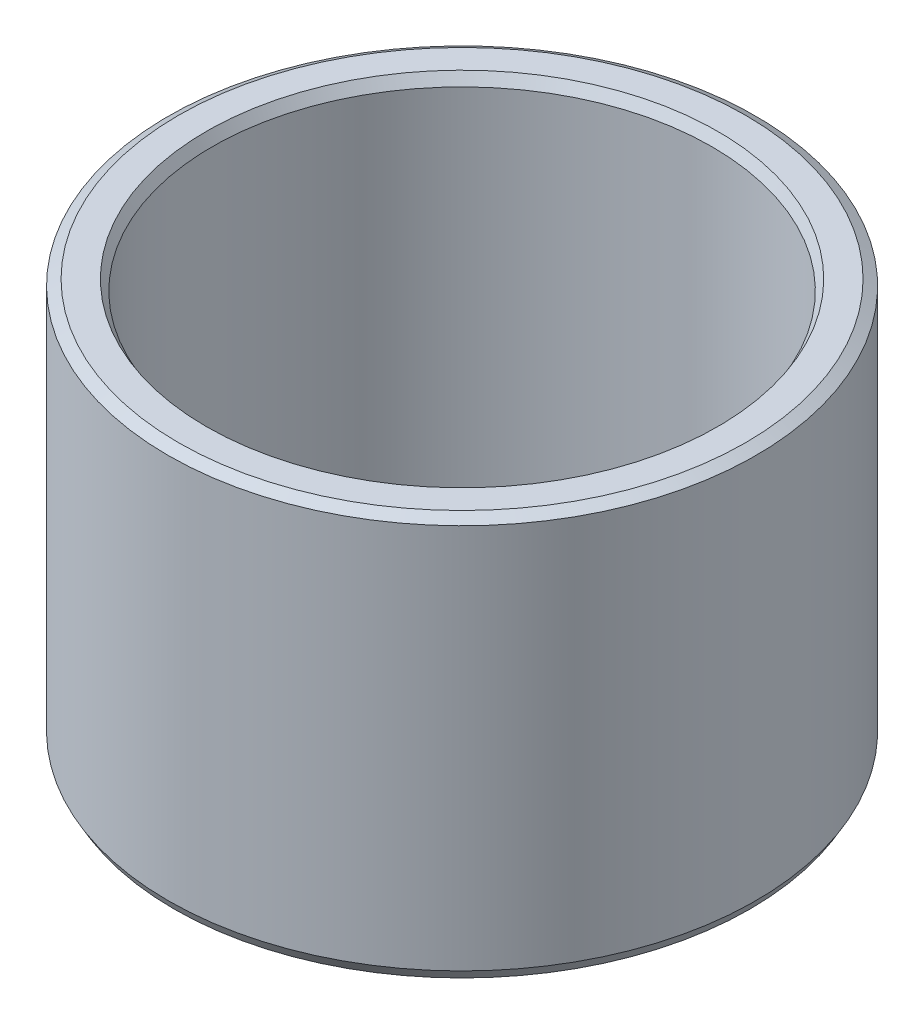
ISO-10303-21;
HEADER;
FILE_DESCRIPTION(('STEP AP214'),'2;1');
FILE_NAME('part.step','',(''),(''),'','','');
FILE_SCHEMA(('AUTOMOTIVE_DESIGN { 1 0 10303 214 1 1 1 1 }'));
ENDSEC;
DATA;
#1=APPLICATION_CONTEXT('core data for automotive mechanical design processes');
#2=APPLICATION_PROTOCOL_DEFINITION('international standard','automotive_design',2000,#1);
#3=PRODUCT_CONTEXT('',#1,'mechanical');
#4=PRODUCT('Part','Part','',(#3));
#5=PRODUCT_RELATED_PRODUCT_CATEGORY('part','',(#4));
#6=PRODUCT_DEFINITION_FORMATION('','',#4);
#7=PRODUCT_DEFINITION_CONTEXT('part definition',#1,'design');
#8=PRODUCT_DEFINITION('design','',#6,#7);
#9=PRODUCT_DEFINITION_SHAPE('','',#8);
#10=(LENGTH_UNIT() NAMED_UNIT(*) SI_UNIT(.MILLI.,.METRE.));
#11=(NAMED_UNIT(*) PLANE_ANGLE_UNIT() SI_UNIT($,.RADIAN.));
#12=(NAMED_UNIT(*) SI_UNIT($,.STERADIAN.) SOLID_ANGLE_UNIT());
#13=UNCERTAINTY_MEASURE_WITH_UNIT(LENGTH_MEASURE(1.E-05),#10,'distance_accuracy_value','');
#14=(GEOMETRIC_REPRESENTATION_CONTEXT(3) GLOBAL_UNCERTAINTY_ASSIGNED_CONTEXT((#13)) GLOBAL_UNIT_ASSIGNED_CONTEXT((#10,
#11,#12)) REPRESENTATION_CONTEXT('',''));
#15=CARTESIAN_POINT('',(0.,0.,0.));
#16=DIRECTION('',(0.,0.,1.));
#17=DIRECTION('',(1.,0.,0.));
#18=AXIS2_PLACEMENT_3D('',#15,#16,#17);
#19=CARTESIAN_POINT('',(0.,44.4365752753032,0.));
#20=DIRECTION('',(0.,-1.,0.));
#21=DIRECTION('',(0.,0.,-1.));
#22=AXIS2_PLACEMENT_3D('',#19,#20,#21);
#23=CYLINDRICAL_SURFACE('',#22,32.5);
#24=CARTESIAN_POINT('',(0.,1.13785269703768,0.));
#25=DIRECTION('',(0.,1.,0.));
#26=DIRECTION('',(0.,0.,1.));
#27=AXIS2_PLACEMENT_3D('',#24,#25,#26);
#28=CIRCLE('',#27,32.5);
#29=CARTESIAN_POINT('',(0.,1.13785269703768,32.5));
#30=VERTEX_POINT('',#29);
#31=EDGE_CURVE('E10',#30,#30,#28,.T.);
#32=ORIENTED_EDGE('',*,*,#31,.T.);
#33=EDGE_LOOP('',(#32));
#34=FACE_BOUND('',#33,.T.);
#35=CARTESIAN_POINT('',(0.,43.7796357143703,0.));
#36=DIRECTION('',(0.,1.,0.));
#37=DIRECTION('',(0.,0.,1.));
#38=AXIS2_PLACEMENT_3D('',#35,#36,#37);
#39=CIRCLE('',#38,32.5);
#40=CARTESIAN_POINT('',(0.,43.7796357143703,32.5));
#41=VERTEX_POINT('',#40);
#42=EDGE_CURVE('E50',#41,#41,#39,.F.);
#43=ORIENTED_EDGE('',*,*,#42,.T.);
#44=EDGE_LOOP('',(#43));
#45=FACE_BOUND('',#44,.T.);
#46=ADVANCED_FACE('F39',(#34,#45),#23,.T.);
#47=CARTESIAN_POINT('',(0.,44.4365752753032,0.));
#48=DIRECTION('',(0.,1.,0.));
#49=DIRECTION('',(0.,0.,1.));
#50=AXIS2_PLACEMENT_3D('',#47,#48,#49);
#51=PLANE('',#50);
#52=CARTESIAN_POINT('',(0.,44.4365752753032,0.));
#53=DIRECTION('',(0.,1.,0.));
#54=DIRECTION('',(0.,0.,1.));
#55=AXIS2_PLACEMENT_3D('',#52,#53,#54);
#56=CIRCLE('',#55,28.2857885351654);
#57=CARTESIAN_POINT('',(0.,44.4365752753032,28.2857885351654));
#58=VERTEX_POINT('',#57);
#59=EDGE_CURVE('E58',#58,#58,#56,.F.);
#60=ORIENTED_EDGE('',*,*,#59,.T.);
#61=EDGE_LOOP('',(#60));
#62=FACE_BOUND('',#61,.T.);
#63=CARTESIAN_POINT('',(0.,44.4365752753032,0.));
#64=DIRECTION('',(0.,1.,0.));
#65=DIRECTION('',(0.,0.,1.));
#66=AXIS2_PLACEMENT_3D('',#63,#64,#65);
#67=CIRCLE('',#66,31.3621473029623);
#68=CARTESIAN_POINT('',(0.,44.4365752753032,31.3621473029623));
#69=VERTEX_POINT('',#68);
#70=EDGE_CURVE('E61',#69,#69,#67,.T.);
#71=ORIENTED_EDGE('',*,*,#70,.T.);
#72=EDGE_LOOP('',(#71));
#73=FACE_BOUND('',#72,.T.);
#74=ADVANCED_FACE('F88',(#62,#73),#51,.T.);
#75=CARTESIAN_POINT('',(0.,0.,0.));
#76=DIRECTION('',(0.,1.,0.));
#77=DIRECTION('',(0.,0.,1.));
#78=AXIS2_PLACEMENT_3D('',#75,#76,#77);
#79=PLANE('',#78);
#80=CARTESIAN_POINT('',(0.,0.,0.));
#81=DIRECTION('',(0.,1.,0.));
#82=DIRECTION('',(0.,0.,1.));
#83=AXIS2_PLACEMENT_3D('',#80,#81,#82);
#84=CIRCLE('',#83,28.7667016712702);
#85=CARTESIAN_POINT('',(0.,0.,28.7667016712702));
#86=VERTEX_POINT('',#85);
#87=EDGE_CURVE('E51',#86,#86,#84,.T.);
#88=ORIENTED_EDGE('',*,*,#87,.T.);
#89=EDGE_LOOP('',(#88));
#90=FACE_BOUND('',#89,.T.);
#91=CARTESIAN_POINT('',(0.,0.,0.));
#92=DIRECTION('',(0.,1.,0.));
#93=DIRECTION('',(0.,0.,1.));
#94=AXIS2_PLACEMENT_3D('',#91,#92,#93);
#95=CIRCLE('',#94,31.8430604390672);
#96=CARTESIAN_POINT('',(0.,0.,31.8430604390672));
#97=VERTEX_POINT('',#96);
#98=EDGE_CURVE('E54',#97,#97,#95,.F.);
#99=ORIENTED_EDGE('',*,*,#98,.T.);
#100=EDGE_LOOP('',(#99));
#101=FACE_BOUND('',#100,.T.);
#102=ADVANCED_FACE('F83',(#90,#101),#79,.F.);
#103=CARTESIAN_POINT('',(0.,44.4365752753032,0.));
#104=DIRECTION('',(0.,-1.,0.));
#105=DIRECTION('',(0.,0.,-1.));
#106=AXIS2_PLACEMENT_3D('',#103,#104,#105);
#107=CYLINDRICAL_SURFACE('',#106,27.6288489742326);
#108=CARTESIAN_POINT('',(0.,43.2987225782656,0.));
#109=DIRECTION('',(0.,1.,0.));
#110=DIRECTION('',(0.,0.,1.));
#111=AXIS2_PLACEMENT_3D('',#108,#109,#110);
#112=CIRCLE('',#111,27.6288489742326);
#113=CARTESIAN_POINT('',(0.,43.2987225782656,27.6288489742326));
#114=VERTEX_POINT('',#113);
#115=EDGE_CURVE('E67',#114,#114,#112,.T.);
#116=ORIENTED_EDGE('',*,*,#115,.T.);
#117=EDGE_LOOP('',(#116));
#118=FACE_BOUND('',#117,.T.);
#119=CARTESIAN_POINT('',(0.,0.656939560932837,0.));
#120=DIRECTION('',(0.,1.,0.));
#121=DIRECTION('',(0.,0.,1.));
#122=AXIS2_PLACEMENT_3D('',#119,#120,#121);
#123=CIRCLE('',#122,27.6288489742326);
#124=CARTESIAN_POINT('',(0.,0.656939560932837,27.6288489742326));
#125=VERTEX_POINT('',#124);
#126=EDGE_CURVE('E69',#125,#125,#123,.F.);
#127=ORIENTED_EDGE('',*,*,#126,.T.);
#128=EDGE_LOOP('',(#127));
#129=FACE_BOUND('',#128,.T.);
#130=ADVANCED_FACE('F71',(#118,#129),#107,.F.);
#131=CARTESIAN_POINT('',(0.,43.2987225782656,0.));
#132=DIRECTION('',(0.,1.,0.));
#133=DIRECTION('',(0.,0.,1.));
#134=AXIS2_PLACEMENT_3D('',#131,#132,#133);
#135=CONICAL_SURFACE('',#134,27.6288489742326,0.523598775598292);
#136=ORIENTED_EDGE('',*,*,#59,.F.);
#137=EDGE_LOOP('',(#136));
#138=FACE_BOUND('',#137,.T.);
#139=ORIENTED_EDGE('',*,*,#115,.F.);
#140=EDGE_LOOP('',(#139));
#141=FACE_BOUND('',#140,.T.);
#142=ADVANCED_FACE('F77',(#138,#141),#135,.F.);
#143=CARTESIAN_POINT('',(0.,0.,0.));
#144=DIRECTION('',(0.,-1.,0.));
#145=DIRECTION('',(0.,0.,-1.));
#146=AXIS2_PLACEMENT_3D('',#143,#144,#145);
#147=CONICAL_SURFACE('',#146,28.7667016712702,1.04719755119659);
#148=ORIENTED_EDGE('',*,*,#126,.F.);
#149=EDGE_LOOP('',(#148));
#150=FACE_BOUND('',#149,.T.);
#151=ORIENTED_EDGE('',*,*,#87,.F.);
#152=EDGE_LOOP('',(#151));
#153=FACE_BOUND('',#152,.T.);
#154=ADVANCED_FACE('F73',(#150,#153),#147,.F.);
#155=CARTESIAN_POINT('',(0.,1.13785269703768,0.));
#156=DIRECTION('',(0.,1.,0.));
#157=DIRECTION('',(0.,0.,1.));
#158=AXIS2_PLACEMENT_3D('',#155,#156,#157);
#159=CONICAL_SURFACE('',#158,32.5,0.523598775598302);
#160=ORIENTED_EDGE('',*,*,#98,.F.);
#161=EDGE_LOOP('',(#160));
#162=FACE_BOUND('',#161,.T.);
#163=ORIENTED_EDGE('',*,*,#31,.F.);
#164=EDGE_LOOP('',(#163));
#165=FACE_BOUND('',#164,.T.);
#166=ADVANCED_FACE('F76',(#162,#165),#159,.T.);
#167=CARTESIAN_POINT('',(0.,44.4365752753032,0.));
#168=DIRECTION('',(0.,-1.,0.));
#169=DIRECTION('',(0.,0.,-1.));
#170=AXIS2_PLACEMENT_3D('',#167,#168,#169);
#171=CONICAL_SURFACE('',#170,31.3621473029623,1.0471975511966);
#172=ORIENTED_EDGE('',*,*,#42,.F.);
#173=EDGE_LOOP('',(#172));
#174=FACE_BOUND('',#173,.T.);
#175=ORIENTED_EDGE('',*,*,#70,.F.);
#176=EDGE_LOOP('',(#175));
#177=FACE_BOUND('',#176,.T.);
#178=ADVANCED_FACE('F45',(#174,#177),#171,.T.);
#179=CLOSED_SHELL('',(#46,#74,#102,#130,#142,#154,#166,#178));
#180=MANIFOLD_SOLID_BREP('B2',#179);
#181=ADVANCED_BREP_SHAPE_REPRESENTATION('',(#18,#180),#14);
#182=SHAPE_DEFINITION_REPRESENTATION(#9,#181);
ENDSEC;
END-ISO-10303-21;
